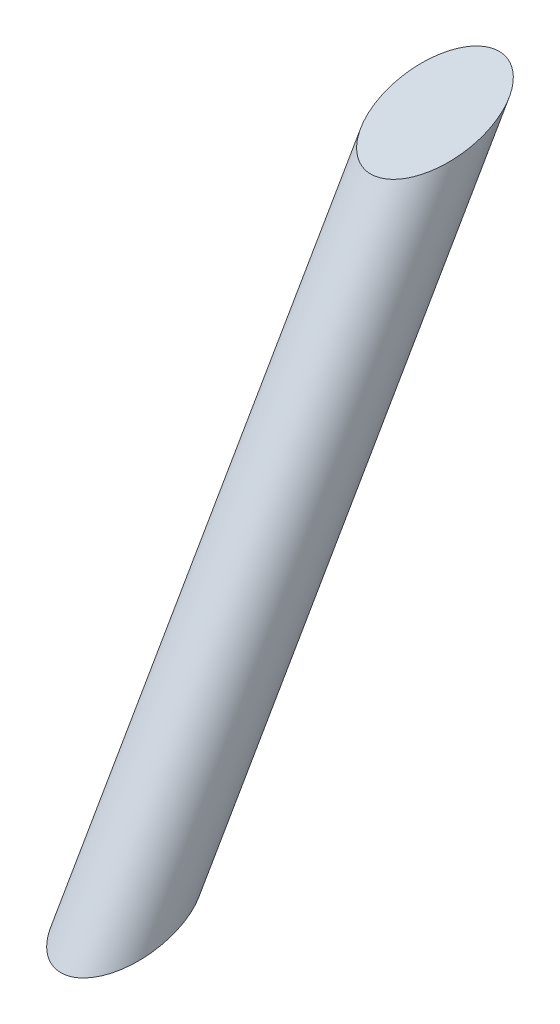
ISO-10303-21;
HEADER;
FILE_DESCRIPTION(('STEP AP214'),'2;1');
FILE_NAME('part.step','',(''),(''),'','','');
FILE_SCHEMA(('AUTOMOTIVE_DESIGN { 1 0 10303 214 1 1 1 1 }'));
ENDSEC;
DATA;
#1=APPLICATION_CONTEXT('core data for automotive mechanical design processes');
#2=APPLICATION_PROTOCOL_DEFINITION('international standard','automotive_design',2000,#1);
#3=PRODUCT_CONTEXT('',#1,'mechanical');
#4=PRODUCT('Part','Part','',(#3));
#5=PRODUCT_RELATED_PRODUCT_CATEGORY('part','',(#4));
#6=PRODUCT_DEFINITION_FORMATION('','',#4);
#7=PRODUCT_DEFINITION_CONTEXT('part definition',#1,'design');
#8=PRODUCT_DEFINITION('design','',#6,#7);
#9=PRODUCT_DEFINITION_SHAPE('','',#8);
#10=(LENGTH_UNIT() NAMED_UNIT(*) SI_UNIT(.MILLI.,.METRE.));
#11=(NAMED_UNIT(*) PLANE_ANGLE_UNIT() SI_UNIT($,.RADIAN.));
#12=(NAMED_UNIT(*) SI_UNIT($,.STERADIAN.) SOLID_ANGLE_UNIT());
#13=UNCERTAINTY_MEASURE_WITH_UNIT(LENGTH_MEASURE(1.E-05),#10,'distance_accuracy_value','');
#14=(GEOMETRIC_REPRESENTATION_CONTEXT(3) GLOBAL_UNCERTAINTY_ASSIGNED_CONTEXT((#13)) GLOBAL_UNIT_ASSIGNED_CONTEXT((#10,
#11,#12)) REPRESENTATION_CONTEXT('',''));
#15=CARTESIAN_POINT('',(0.,0.,0.));
#16=DIRECTION('',(0.,0.,1.));
#17=DIRECTION('',(1.,0.,0.));
#18=AXIS2_PLACEMENT_3D('',#15,#16,#17);
#19=CARTESIAN_POINT('',(0.,-44.2665851297457,24.8276121225511));
#20=DIRECTION('',(0.,-0.866025403784439,0.5));
#21=DIRECTION('',(0.,-0.5,-0.866025403784439));
#22=AXIS2_PLACEMENT_3D('',#19,#20,#21);
#23=CYLINDRICAL_SURFACE('',#22,9.99999999999999);
#24=CARTESIAN_POINT('',(0.,-34.5841267642272,19.2374421788017));
#25=DIRECTION('',(0.,-0.950028265439591,-0.31216389103457));
#26=DIRECTION('',(0.,-0.31216389103457,0.950028265439591));
#27=AXIS2_PLACEMENT_3D('',#24,#25,#26);
#28=ELLIPSE('',#27,15.,9.99999999999999);
#29=CARTESIAN_POINT('',(0.,-39.2665851297457,33.4878661603955));
#30=VERTEX_POINT('',#29);
#31=EDGE_CURVE('E10',#30,#30,#28,.F.);
#32=ORIENTED_EDGE('',*,*,#31,.T.);
#33=EDGE_LOOP('',(#32));
#34=FACE_BOUND('',#33,.T.);
#35=CARTESIAN_POINT('',(0.,84.6150211102461,-49.5822179336995));
#36=DIRECTION('',(0.,0.950028265439591,0.31216389103457));
#37=DIRECTION('',(0.,-0.31216389103457,0.950028265439591));
#38=AXIS2_PLACEMENT_3D('',#35,#36,#37);
#39=ELLIPSE('',#38,15.,9.99999999999999);
#40=CARTESIAN_POINT('',(0.,79.9325627447275,-35.3317939521056));
#41=VERTEX_POINT('',#40);
#42=EDGE_CURVE('E39',#41,#41,#39,.F.);
#43=ORIENTED_EDGE('',*,*,#42,.T.);
#44=EDGE_LOOP('',(#43));
#45=FACE_BOUND('',#44,.T.);
#46=ADVANCED_FACE('F33',(#34,#45),#23,.T.);
#47=CARTESIAN_POINT('',(10.,-29.9016683987086,4.98701819720781));
#48=DIRECTION('',(0.,-0.950028265439591,-0.31216389103457));
#49=DIRECTION('',(0.,0.31216389103457,-0.950028265439591));
#50=AXIS2_PLACEMENT_3D('',#47,#48,#49);
#51=PLANE('',#50);
#52=ORIENTED_EDGE('',*,*,#31,.F.);
#53=EDGE_LOOP('',(#52));
#54=FACE_BOUND('',#53,.T.);
#55=ADVANCED_FACE('F48',(#54),#51,.T.);
#56=CARTESIAN_POINT('',(10.,79.9325627447275,-35.3317939521056));
#57=DIRECTION('',(0.,0.950028265439591,0.31216389103457));
#58=DIRECTION('',(0.,-0.31216389103457,0.950028265439591));
#59=AXIS2_PLACEMENT_3D('',#56,#57,#58);
#60=PLANE('',#59);
#61=ORIENTED_EDGE('',*,*,#42,.F.);
#62=EDGE_LOOP('',(#61));
#63=FACE_BOUND('',#62,.T.);
#64=ADVANCED_FACE('F46',(#63),#60,.T.);
#65=CLOSED_SHELL('',(#46,#55,#64));
#66=MANIFOLD_SOLID_BREP('B2',#65);
#67=ADVANCED_BREP_SHAPE_REPRESENTATION('',(#18,#66),#14);
#68=SHAPE_DEFINITION_REPRESENTATION(#9,#67);
ENDSEC;
END-ISO-10303-21;
